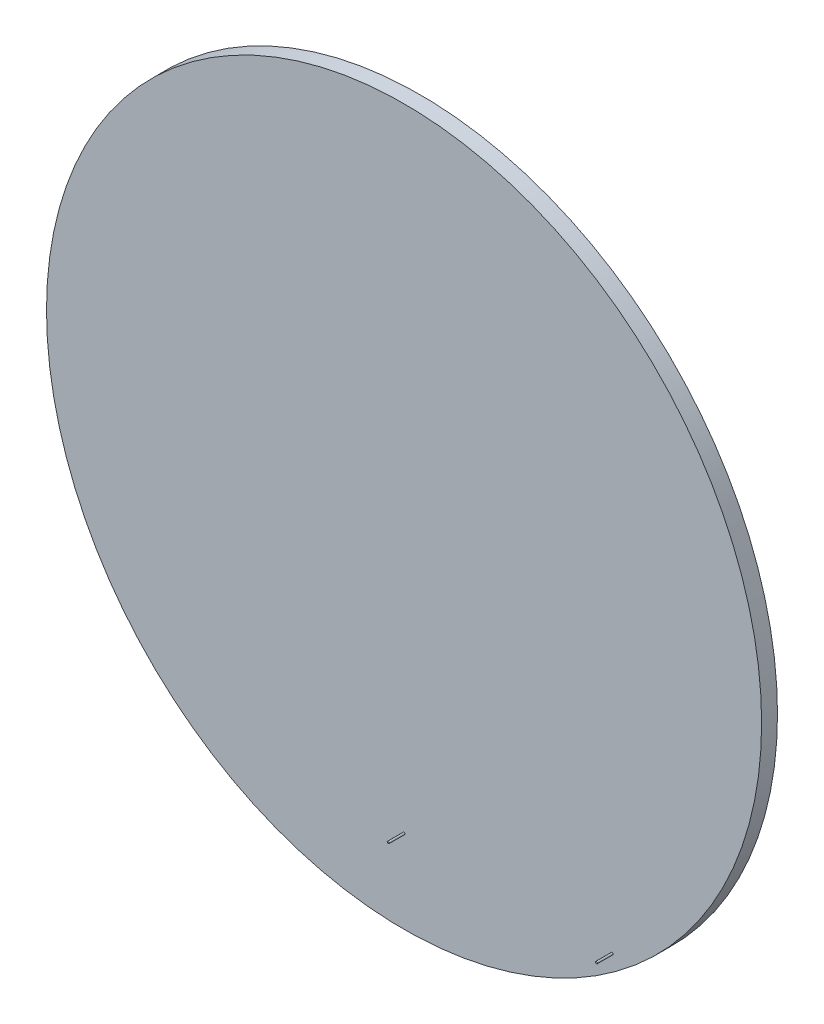
ISO-10303-21;
HEADER;
FILE_DESCRIPTION(('STEP AP214'),'2;1');
FILE_NAME('part.step','',(''),(''),'','','');
FILE_SCHEMA(('AUTOMOTIVE_DESIGN { 1 0 10303 214 1 1 1 1 }'));
ENDSEC;
DATA;
#1=APPLICATION_CONTEXT('core data for automotive mechanical design processes');
#2=APPLICATION_PROTOCOL_DEFINITION('international standard','automotive_design',2000,#1);
#3=PRODUCT_CONTEXT('',#1,'mechanical');
#4=PRODUCT('Part','Part','',(#3));
#5=PRODUCT_RELATED_PRODUCT_CATEGORY('part','',(#4));
#6=PRODUCT_DEFINITION_FORMATION('','',#4);
#7=PRODUCT_DEFINITION_CONTEXT('part definition',#1,'design');
#8=PRODUCT_DEFINITION('design','',#6,#7);
#9=PRODUCT_DEFINITION_SHAPE('','',#8);
#10=(LENGTH_UNIT() NAMED_UNIT(*) SI_UNIT(.MILLI.,.METRE.));
#11=(NAMED_UNIT(*) PLANE_ANGLE_UNIT() SI_UNIT($,.RADIAN.));
#12=(NAMED_UNIT(*) SI_UNIT($,.STERADIAN.) SOLID_ANGLE_UNIT());
#13=UNCERTAINTY_MEASURE_WITH_UNIT(LENGTH_MEASURE(1.E-05),#10,'distance_accuracy_value','');
#14=(GEOMETRIC_REPRESENTATION_CONTEXT(3) GLOBAL_UNCERTAINTY_ASSIGNED_CONTEXT((#13)) GLOBAL_UNIT_ASSIGNED_CONTEXT((#10,
#11,#12)) REPRESENTATION_CONTEXT('',''));
#15=CARTESIAN_POINT('',(0.,0.,0.));
#16=DIRECTION('',(0.,0.,1.));
#17=DIRECTION('',(1.,0.,0.));
#18=AXIS2_PLACEMENT_3D('',#15,#16,#17);
#19=CARTESIAN_POINT('',(0.,0.,25.4));
#20=DIRECTION('',(0.,0.,1.));
#21=DIRECTION('',(1.,0.,0.));
#22=AXIS2_PLACEMENT_3D('',#19,#20,#21);
#23=PLANE('',#22);
#24=CARTESIAN_POINT('',(0.,-439.3184,25.4));
#25=DIRECTION('',(0.,0.,1.));
#26=DIRECTION('',(1.,0.,0.));
#27=AXIS2_PLACEMENT_3D('',#24,#25,#26);
#28=CIRCLE('',#27,1.5875);
#29=CARTESIAN_POINT('',(1.5875,-439.3184,25.4));
#30=VERTEX_POINT('',#29);
#31=EDGE_CURVE('E42',#30,#30,#28,.T.);
#32=ORIENTED_EDGE('',*,*,#31,.F.);
#33=EDGE_LOOP('',(#32));
#34=FACE_BOUND('',#33,.T.);
#35=CARTESIAN_POINT('',(0.,0.,25.4));
#36=DIRECTION('',(0.,0.,1.));
#37=DIRECTION('',(1.,0.,0.));
#38=AXIS2_PLACEMENT_3D('',#35,#36,#37);
#39=CIRCLE('',#38,572.6684);
#40=CARTESIAN_POINT('',(572.6684,0.,25.4));
#41=VERTEX_POINT('',#40);
#42=EDGE_CURVE('E10',#41,#41,#39,.T.);
#43=ORIENTED_EDGE('',*,*,#42,.T.);
#44=EDGE_LOOP('',(#43));
#45=FACE_BOUND('',#44,.T.);
#46=CARTESIAN_POINT('',(333.375,-439.3184,25.4));
#47=DIRECTION('',(0.,0.,1.));
#48=DIRECTION('',(1.,0.,0.));
#49=AXIS2_PLACEMENT_3D('',#46,#47,#48);
#50=CIRCLE('',#49,1.58749999999999);
#51=CARTESIAN_POINT('',(334.9625,-439.3184,25.4));
#52=VERTEX_POINT('',#51);
#53=EDGE_CURVE('E48',#52,#52,#50,.T.);
#54=ORIENTED_EDGE('',*,*,#53,.F.);
#55=EDGE_LOOP('',(#54));
#56=FACE_BOUND('',#55,.T.);
#57=ADVANCED_FACE('F29',(#34,#45,#56),#23,.T.);
#58=CARTESIAN_POINT('',(0.,0.,25.4));
#59=DIRECTION('',(0.,0.,-1.));
#60=DIRECTION('',(-1.,0.,0.));
#61=AXIS2_PLACEMENT_3D('',#58,#59,#60);
#62=CYLINDRICAL_SURFACE('',#61,572.6684);
#63=ORIENTED_EDGE('',*,*,#42,.F.);
#64=EDGE_LOOP('',(#63));
#65=FACE_BOUND('',#64,.T.);
#66=CARTESIAN_POINT('',(0.,0.,0.));
#67=DIRECTION('',(0.,0.,1.));
#68=DIRECTION('',(1.,0.,0.));
#69=AXIS2_PLACEMENT_3D('',#66,#67,#68);
#70=CIRCLE('',#69,572.6684);
#71=CARTESIAN_POINT('',(572.6684,0.,0.));
#72=VERTEX_POINT('',#71);
#73=EDGE_CURVE('E33',#72,#72,#70,.T.);
#74=ORIENTED_EDGE('',*,*,#73,.T.);
#75=EDGE_LOOP('',(#74));
#76=FACE_BOUND('',#75,.T.);
#77=ADVANCED_FACE('F31',(#65,#76),#62,.T.);
#78=CARTESIAN_POINT('',(0.,0.,0.));
#79=DIRECTION('',(0.,0.,1.));
#80=DIRECTION('',(1.,0.,0.));
#81=AXIS2_PLACEMENT_3D('',#78,#79,#80);
#82=PLANE('',#81);
#83=ORIENTED_EDGE('',*,*,#73,.F.);
#84=EDGE_LOOP('',(#83));
#85=FACE_BOUND('',#84,.T.);
#86=ADVANCED_FACE('F69',(#85),#82,.F.);
#87=CARTESIAN_POINT('',(0.,-439.3184,50.8));
#88=DIRECTION('',(0.,0.,-1.));
#89=DIRECTION('',(-1.,0.,0.));
#90=AXIS2_PLACEMENT_3D('',#87,#88,#89);
#91=CYLINDRICAL_SURFACE('',#90,1.5875);
#92=CARTESIAN_POINT('',(0.,-439.3184,50.8));
#93=DIRECTION('',(0.,0.,1.));
#94=DIRECTION('',(1.,0.,0.));
#95=AXIS2_PLACEMENT_3D('',#92,#93,#94);
#96=CIRCLE('',#95,1.5875);
#97=CARTESIAN_POINT('',(1.5875,-439.3184,50.8));
#98=VERTEX_POINT('',#97);
#99=EDGE_CURVE('E40',#98,#98,#96,.T.);
#100=ORIENTED_EDGE('',*,*,#99,.F.);
#101=EDGE_LOOP('',(#100));
#102=FACE_BOUND('',#101,.T.);
#103=ORIENTED_EDGE('',*,*,#31,.T.);
#104=EDGE_LOOP('',(#103));
#105=FACE_BOUND('',#104,.T.);
#106=ADVANCED_FACE('F73',(#102,#105),#91,.T.);
#107=CARTESIAN_POINT('',(0.,-439.3184,50.8));
#108=DIRECTION('',(0.,0.,1.));
#109=DIRECTION('',(1.,0.,0.));
#110=AXIS2_PLACEMENT_3D('',#107,#108,#109);
#111=PLANE('',#110);
#112=ORIENTED_EDGE('',*,*,#99,.T.);
#113=EDGE_LOOP('',(#112));
#114=FACE_BOUND('',#113,.T.);
#115=ADVANCED_FACE('F59',(#114),#111,.T.);
#116=CARTESIAN_POINT('',(333.375,-439.3184,50.8));
#117=DIRECTION('',(0.,0.,-1.));
#118=DIRECTION('',(-1.,0.,0.));
#119=AXIS2_PLACEMENT_3D('',#116,#117,#118);
#120=CYLINDRICAL_SURFACE('',#119,1.58749999999999);
#121=CARTESIAN_POINT('',(333.375,-439.3184,50.8));
#122=DIRECTION('',(0.,0.,1.));
#123=DIRECTION('',(1.,0.,0.));
#124=AXIS2_PLACEMENT_3D('',#121,#122,#123);
#125=CIRCLE('',#124,1.58749999999999);
#126=CARTESIAN_POINT('',(334.9625,-439.3184,50.8));
#127=VERTEX_POINT('',#126);
#128=EDGE_CURVE('E45',#127,#127,#125,.T.);
#129=ORIENTED_EDGE('',*,*,#128,.F.);
#130=EDGE_LOOP('',(#129));
#131=FACE_BOUND('',#130,.T.);
#132=ORIENTED_EDGE('',*,*,#53,.T.);
#133=EDGE_LOOP('',(#132));
#134=FACE_BOUND('',#133,.T.);
#135=ADVANCED_FACE('F56',(#131,#134),#120,.T.);
#136=CARTESIAN_POINT('',(333.375,-439.3184,50.8));
#137=DIRECTION('',(0.,0.,1.));
#138=DIRECTION('',(1.,0.,0.));
#139=AXIS2_PLACEMENT_3D('',#136,#137,#138);
#140=PLANE('',#139);
#141=ORIENTED_EDGE('',*,*,#128,.T.);
#142=EDGE_LOOP('',(#141));
#143=FACE_BOUND('',#142,.T.);
#144=ADVANCED_FACE('F54',(#143),#140,.T.);
#145=CLOSED_SHELL('',(#57,#77,#86,#106,#115,#135,#144));
#146=MANIFOLD_SOLID_BREP('B2',#145);
#147=ADVANCED_BREP_SHAPE_REPRESENTATION('',(#18,#146),#14);
#148=SHAPE_DEFINITION_REPRESENTATION(#9,#147);
ENDSEC;
END-ISO-10303-21;
